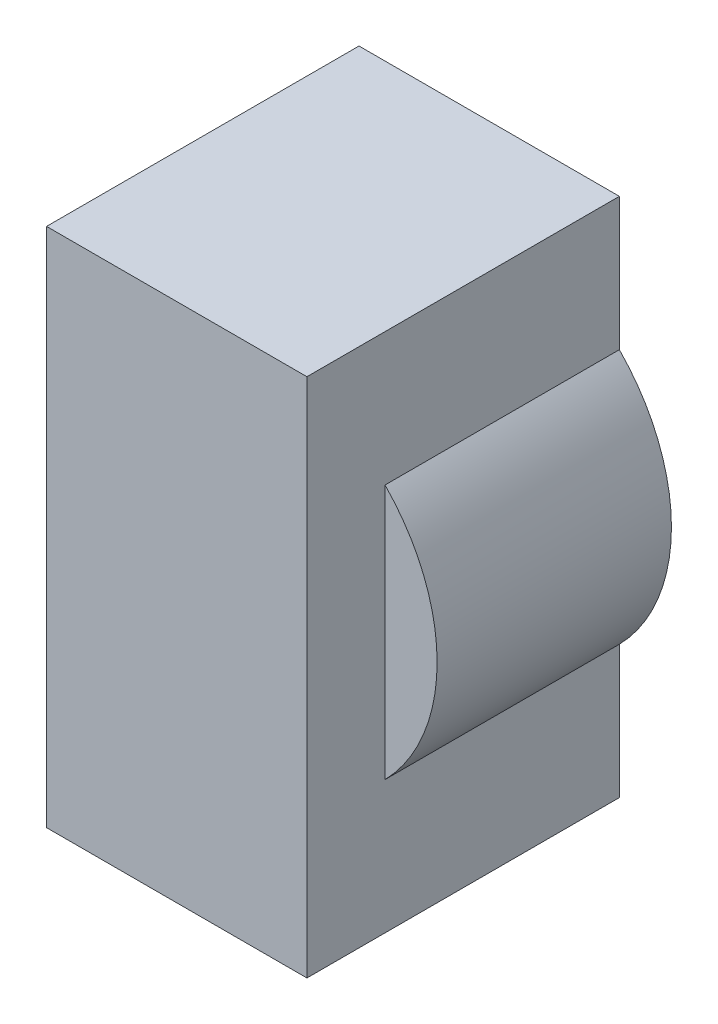
ISO-10303-21;
HEADER;
FILE_DESCRIPTION(('STEP AP214'),'2;1');
FILE_NAME('part.step','',(''),(''),'','','');
FILE_SCHEMA(('AUTOMOTIVE_DESIGN { 1 0 10303 214 1 1 1 1 }'));
ENDSEC;
DATA;
#1=APPLICATION_CONTEXT('core data for automotive mechanical design processes');
#2=APPLICATION_PROTOCOL_DEFINITION('international standard','automotive_design',2000,#1);
#3=PRODUCT_CONTEXT('',#1,'mechanical');
#4=PRODUCT('Part','Part','',(#3));
#5=PRODUCT_RELATED_PRODUCT_CATEGORY('part','',(#4));
#6=PRODUCT_DEFINITION_FORMATION('','',#4);
#7=PRODUCT_DEFINITION_CONTEXT('part definition',#1,'design');
#8=PRODUCT_DEFINITION('design','',#6,#7);
#9=PRODUCT_DEFINITION_SHAPE('','',#8);
#10=(LENGTH_UNIT() NAMED_UNIT(*) SI_UNIT(.MILLI.,.METRE.));
#11=(NAMED_UNIT(*) PLANE_ANGLE_UNIT() SI_UNIT($,.RADIAN.));
#12=(NAMED_UNIT(*) SI_UNIT($,.STERADIAN.) SOLID_ANGLE_UNIT());
#13=UNCERTAINTY_MEASURE_WITH_UNIT(LENGTH_MEASURE(1.E-05),#10,'distance_accuracy_value','');
#14=(GEOMETRIC_REPRESENTATION_CONTEXT(3) GLOBAL_UNCERTAINTY_ASSIGNED_CONTEXT((#13)) GLOBAL_UNIT_ASSIGNED_CONTEXT((#10,
#11,#12)) REPRESENTATION_CONTEXT('',''));
#15=CARTESIAN_POINT('',(0.,0.,0.));
#16=DIRECTION('',(0.,0.,1.));
#17=DIRECTION('',(1.,0.,0.));
#18=AXIS2_PLACEMENT_3D('',#15,#16,#17);
#19=CARTESIAN_POINT('',(-2.11893799901009,-0.126876243956829,6.));
#20=DIRECTION('',(1.,0.,0.));
#21=DIRECTION('',(0.,1.,4.37113882867379E-08));
#22=AXIS2_PLACEMENT_3D('',#19,#20,#21);
#23=PLANE('',#22);
#24=DIRECTION('',(0.,4.37113880893649E-08,-0.999999999999999));
#25=VECTOR('',#24,1.);
#26=CARTESIAN_POINT('',(-2.11893799901009,-2.57636592117275,4.4999998929294));
#27=LINE('',#26,#25);
#28=CARTESIAN_POINT('',(-2.11893799901009,-2.57636592117275,4.4999998929294));
#29=VERTEX_POINT('',#28);
#30=CARTESIAN_POINT('',(-2.11893799901009,-2.5763657244715,-1.0707059725117E-07));
#31=VERTEX_POINT('',#30);
#32=EDGE_CURVE('E11',#29,#31,#27,.T.);
#33=ORIENTED_EDGE('',*,*,#32,.T.);
#34=DIRECTION('',(0.,-0.999999999999999,-4.37113882867379E-08));
#35=VECTOR('',#34,1.);
#36=CARTESIAN_POINT('',(-2.11893799901009,-2.5763657244715,-1.0707059725117E-07));
#37=LINE('',#36,#35);
#38=CARTESIAN_POINT('',(-2.11893799901009,-5.1268759816885,-2.1855694143369E-07));
#39=VERTEX_POINT('',#38);
#40=EDGE_CURVE('E141',#31,#39,#37,.T.);
#41=ORIENTED_EDGE('',*,*,#40,.T.);
#42=DIRECTION('',(0.,4.37113882867379E-08,-0.999999999999999));
#43=VECTOR('',#42,1.);
#44=CARTESIAN_POINT('',(-2.11893799901009,-5.12687624395683,5.99999978144306));
#45=LINE('',#44,#43);
#46=CARTESIAN_POINT('',(-2.11893799901009,-5.12687624395683,5.99999978144306));
#47=VERTEX_POINT('',#46);
#48=EDGE_CURVE('E132',#47,#39,#45,.T.);
#49=ORIENTED_EDGE('',*,*,#48,.F.);
#50=DIRECTION('',(0.,-0.999999999999999,-4.37113882867379E-08));
#51=VECTOR('',#50,1.);
#52=CARTESIAN_POINT('',(-2.11893799901009,4.87312375604317,6.00000021855694));
#53=LINE('',#52,#51);
#54=CARTESIAN_POINT('',(-2.11893799901009,4.87312375604317,6.00000021855694));
#55=VERTEX_POINT('',#54);
#56=EDGE_CURVE('E121',#55,#47,#53,.T.);
#57=ORIENTED_EDGE('',*,*,#56,.F.);
#58=DIRECTION('',(0.,4.37113882867379E-08,-0.999999999999999));
#59=VECTOR('',#58,1.);
#60=CARTESIAN_POINT('',(-2.11893799901009,4.87312375604317,6.00000021855694));
#61=LINE('',#60,#59);
#62=CARTESIAN_POINT('',(-2.11893799901009,4.8731240183115,2.1855694143369E-07));
#63=VERTEX_POINT('',#62);
#64=EDGE_CURVE('E127',#55,#63,#61,.T.);
#65=ORIENTED_EDGE('',*,*,#64,.T.);
#66=DIRECTION('',(0.,-0.999999999999999,-4.37113882867379E-08));
#67=VECTOR('',#66,1.);
#68=CARTESIAN_POINT('',(-2.11893799901009,4.8731240183115,2.1855694143369E-07));
#69=LINE('',#68,#67);
#70=CARTESIAN_POINT('',(-2.11893799901009,2.3226137610945,1.0707059725117E-07));
#71=VERTEX_POINT('',#70);
#72=EDGE_CURVE('E101',#63,#71,#69,.T.);
#73=ORIENTED_EDGE('',*,*,#72,.T.);
#74=DIRECTION('',(0.,4.37113884841109E-08,-0.999999999999999));
#75=VECTOR('',#74,1.);
#76=CARTESIAN_POINT('',(-2.11893799901009,2.32261356439325,4.5000001070706));
#77=LINE('',#76,#75);
#78=CARTESIAN_POINT('',(-2.11893799901009,2.32261356439325,4.5000001070706));
#79=VERTEX_POINT('',#78);
#80=EDGE_CURVE('E79',#79,#71,#77,.T.);
#81=ORIENTED_EDGE('',*,*,#80,.F.);
#82=DIRECTION('',(0.,-0.999999999999999,-4.37113881160721E-08));
#83=VECTOR('',#82,1.);
#84=CARTESIAN_POINT('',(-2.11893799901009,2.32261356439325,4.5000001070706));
#85=LINE('',#84,#83);
#86=EDGE_CURVE('E77',#79,#29,#85,.T.);
#87=ORIENTED_EDGE('',*,*,#86,.T.);
#88=EDGE_LOOP('',(#33,#41,#49,#57,#65,#73,#81,#87));
#89=FACE_BOUND('',#88,.T.);
#90=ADVANCED_FACE('F17',(#89),#23,.F.);
#91=CARTESIAN_POINT('',(2.88106200098991,-0.126876243956829,6.));
#92=DIRECTION('',(1.,0.,0.));
#93=DIRECTION('',(0.,1.,4.37113882867379E-08));
#94=AXIS2_PLACEMENT_3D('',#91,#92,#93);
#95=PLANE('',#94);
#96=DIRECTION('',(0.,-0.999999999999999,-4.37113882867379E-08));
#97=VECTOR('',#96,1.);
#98=CARTESIAN_POINT('',(2.88106200098991,-2.5763657244715,-1.0707059725117E-07));
#99=LINE('',#98,#97);
#100=CARTESIAN_POINT('',(2.88106200098991,-2.5763657244715,-1.0707059725117E-07));
#101=VERTEX_POINT('',#100);
#102=CARTESIAN_POINT('',(2.88106200098991,-5.1268759816885,-2.1855694143369E-07));
#103=VERTEX_POINT('',#102);
#104=EDGE_CURVE('E24',#101,#103,#99,.T.);
#105=ORIENTED_EDGE('',*,*,#104,.F.);
#106=DIRECTION('',(0.,4.37113880893649E-08,-0.999999999999999));
#107=VECTOR('',#106,1.);
#108=CARTESIAN_POINT('',(2.88106200098991,-2.57636592117275,4.4999998929294));
#109=LINE('',#108,#107);
#110=CARTESIAN_POINT('',(2.88106200098991,-2.57636592117275,4.4999998929294));
#111=VERTEX_POINT('',#110);
#112=EDGE_CURVE('E135',#111,#101,#109,.T.);
#113=ORIENTED_EDGE('',*,*,#112,.F.);
#114=DIRECTION('',(0.,-0.999999999999999,-4.37113881160721E-08));
#115=VECTOR('',#114,1.);
#116=CARTESIAN_POINT('',(2.88106200098991,2.32261356439325,4.5000001070706));
#117=LINE('',#116,#115);
#118=CARTESIAN_POINT('',(2.88106200098991,2.32261356439325,4.5000001070706));
#119=VERTEX_POINT('',#118);
#120=EDGE_CURVE('E124',#119,#111,#117,.T.);
#121=ORIENTED_EDGE('',*,*,#120,.F.);
#122=DIRECTION('',(0.,4.37113884841109E-08,-0.999999999999999));
#123=VECTOR('',#122,1.);
#124=CARTESIAN_POINT('',(2.88106200098991,2.32261356439325,4.5000001070706));
#125=LINE('',#124,#123);
#126=CARTESIAN_POINT('',(2.88106200098991,2.3226137610945,1.0707059725117E-07));
#127=VERTEX_POINT('',#126);
#128=EDGE_CURVE('E111',#119,#127,#125,.T.);
#129=ORIENTED_EDGE('',*,*,#128,.T.);
#130=DIRECTION('',(0.,-0.999999999999999,-4.37113882867379E-08));
#131=VECTOR('',#130,1.);
#132=CARTESIAN_POINT('',(2.88106200098991,4.8731240183115,2.1855694143369E-07));
#133=LINE('',#132,#131);
#134=CARTESIAN_POINT('',(2.88106200098991,4.8731240183115,2.1855694143369E-07));
#135=VERTEX_POINT('',#134);
#136=EDGE_CURVE('E108',#135,#127,#133,.T.);
#137=ORIENTED_EDGE('',*,*,#136,.F.);
#138=DIRECTION('',(0.,4.37113882867379E-08,-0.999999999999999));
#139=VECTOR('',#138,1.);
#140=CARTESIAN_POINT('',(2.88106200098991,4.87312375604317,6.00000021855694));
#141=LINE('',#140,#139);
#142=CARTESIAN_POINT('',(2.88106200098991,4.87312375604317,6.00000021855694));
#143=VERTEX_POINT('',#142);
#144=EDGE_CURVE('E103',#143,#135,#141,.T.);
#145=ORIENTED_EDGE('',*,*,#144,.F.);
#146=DIRECTION('',(0.,-0.999999999999999,-4.37113882867379E-08));
#147=VECTOR('',#146,1.);
#148=CARTESIAN_POINT('',(2.88106200098991,4.87312375604317,6.00000021855694));
#149=LINE('',#148,#147);
#150=CARTESIAN_POINT('',(2.88106200098991,-5.12687624395683,5.99999978144306));
#151=VERTEX_POINT('',#150);
#152=EDGE_CURVE('E118',#143,#151,#149,.T.);
#153=ORIENTED_EDGE('',*,*,#152,.T.);
#154=DIRECTION('',(0.,4.37113882867379E-08,-0.999999999999999));
#155=VECTOR('',#154,1.);
#156=CARTESIAN_POINT('',(2.88106200098991,-5.12687624395683,5.99999978144306));
#157=LINE('',#156,#155);
#158=EDGE_CURVE('E116',#151,#103,#157,.T.);
#159=ORIENTED_EDGE('',*,*,#158,.T.);
#160=EDGE_LOOP('',(#105,#113,#121,#129,#137,#145,#153,#159));
#161=FACE_BOUND('',#160,.T.);
#162=ADVANCED_FACE('F145',(#161),#95,.T.);
#163=CARTESIAN_POINT('',(0.381062000989914,4.87312375604317,6.00000021855694));
#164=DIRECTION('',(0.,1.,4.37113882867379E-08));
#165=DIRECTION('',(-1.,0.,0.));
#166=AXIS2_PLACEMENT_3D('',#163,#164,#165);
#167=PLANE('',#166);
#168=DIRECTION('',(1.,0.,0.));
#169=VECTOR('',#168,1.);
#170=CARTESIAN_POINT('',(-2.11893799901009,4.8731240183115,2.1855694143369E-07));
#171=LINE('',#170,#169);
#172=EDGE_CURVE('E138',#63,#135,#171,.T.);
#173=ORIENTED_EDGE('',*,*,#172,.F.);
#174=ORIENTED_EDGE('',*,*,#64,.F.);
#175=DIRECTION('',(1.,0.,0.));
#176=VECTOR('',#175,1.);
#177=CARTESIAN_POINT('',(-2.11893799901009,4.87312375604317,6.00000021855694));
#178=LINE('',#177,#176);
#179=EDGE_CURVE('E113',#55,#143,#178,.T.);
#180=ORIENTED_EDGE('',*,*,#179,.T.);
#181=ORIENTED_EDGE('',*,*,#144,.T.);
#182=EDGE_LOOP('',(#173,#174,#180,#181));
#183=FACE_BOUND('',#182,.T.);
#184=ADVANCED_FACE('F157',(#183),#167,.T.);
#185=CARTESIAN_POINT('',(0.381062000989914,-5.12687624395683,5.99999978144306));
#186=DIRECTION('',(0.,1.,4.37113882867379E-08));
#187=DIRECTION('',(-1.,0.,0.));
#188=AXIS2_PLACEMENT_3D('',#185,#186,#187);
#189=PLANE('',#188);
#190=DIRECTION('',(1.,0.,0.));
#191=VECTOR('',#190,1.);
#192=CARTESIAN_POINT('',(-2.11893799901009,-5.1268759816885,-2.1855694143369E-07));
#193=LINE('',#192,#191);
#194=EDGE_CURVE('E130',#39,#103,#193,.T.);
#195=ORIENTED_EDGE('',*,*,#194,.T.);
#196=ORIENTED_EDGE('',*,*,#158,.F.);
#197=DIRECTION('',(1.,0.,0.));
#198=VECTOR('',#197,1.);
#199=CARTESIAN_POINT('',(-2.11893799901009,-5.12687624395683,5.99999978144306));
#200=LINE('',#199,#198);
#201=EDGE_CURVE('E105',#47,#151,#200,.T.);
#202=ORIENTED_EDGE('',*,*,#201,.F.);
#203=ORIENTED_EDGE('',*,*,#48,.T.);
#204=EDGE_LOOP('',(#195,#196,#202,#203));
#205=FACE_BOUND('',#204,.T.);
#206=ADVANCED_FACE('F149',(#205),#189,.F.);
#207=CARTESIAN_POINT('',(0.381062000989914,-0.126876243956829,6.));
#208=DIRECTION('',(0.,-4.37113882867379E-08,1.));
#209=DIRECTION('',(0.,-1.,-4.37113882867379E-08));
#210=AXIS2_PLACEMENT_3D('',#207,#208,#209);
#211=PLANE('',#210);
#212=ORIENTED_EDGE('',*,*,#152,.F.);
#213=ORIENTED_EDGE('',*,*,#179,.F.);
#214=ORIENTED_EDGE('',*,*,#56,.T.);
#215=ORIENTED_EDGE('',*,*,#201,.T.);
#216=EDGE_LOOP('',(#212,#213,#214,#215));
#217=FACE_BOUND('',#216,.T.);
#218=ADVANCED_FACE('F151',(#217),#211,.T.);
#219=CARTESIAN_POINT('',(0.381062000989914,-0.126875981688499,0.));
#220=DIRECTION('',(0.,-4.37113882867379E-08,1.));
#221=DIRECTION('',(0.,-1.,-4.37113882867379E-08));
#222=AXIS2_PLACEMENT_3D('',#219,#220,#221);
#223=PLANE('',#222);
#224=ORIENTED_EDGE('',*,*,#136,.T.);
#225=CARTESIAN_POINT('',(0.38106200098991,-0.126875981688499,0.));
#226=DIRECTION('',(0.,-4.37113882867379E-08,1.));
#227=DIRECTION('',(0.71428571428574,-0.699854212223739,-3.05915992146209E-08));
#228=AXIS2_PLACEMENT_3D('',#225,#226,#227);
#229=CIRCLE('',#228,3.5);
#230=EDGE_CURVE('E98',#101,#127,#229,.T.);
#231=ORIENTED_EDGE('',*,*,#230,.F.);
#232=ORIENTED_EDGE('',*,*,#104,.T.);
#233=ORIENTED_EDGE('',*,*,#194,.F.);
#234=ORIENTED_EDGE('',*,*,#40,.F.);
#235=CARTESIAN_POINT('',(0.38106200098991,-0.126875981688499,0.));
#236=DIRECTION('',(0.,-4.37113882867379E-08,1.));
#237=DIRECTION('',(-0.714285714285739,0.69985421222374,3.0591599214621E-08));
#238=AXIS2_PLACEMENT_3D('',#235,#236,#237);
#239=CIRCLE('',#238,3.5);
#240=EDGE_CURVE('E83',#71,#31,#239,.T.);
#241=ORIENTED_EDGE('',*,*,#240,.F.);
#242=ORIENTED_EDGE('',*,*,#72,.F.);
#243=ORIENTED_EDGE('',*,*,#172,.T.);
#244=EDGE_LOOP('',(#224,#231,#232,#233,#234,#241,#242,#243));
#245=FACE_BOUND('',#244,.T.);
#246=ADVANCED_FACE('F144',(#245),#223,.F.);
#247=CARTESIAN_POINT('',(0.38106200098991,-0.126876178389747,4.5));
#248=DIRECTION('',(0.,4.37113882867379E-08,-1.));
#249=DIRECTION('',(0.,1.,4.37113882867379E-08));
#250=AXIS2_PLACEMENT_3D('',#247,#248,#249);
#251=CYLINDRICAL_SURFACE('',#250,3.5);
#252=ORIENTED_EDGE('',*,*,#230,.T.);
#253=ORIENTED_EDGE('',*,*,#128,.F.);
#254=CARTESIAN_POINT('',(0.38106200098991,-0.126876178389747,4.5));
#255=DIRECTION('',(0.,-4.37113882867379E-08,1.));
#256=DIRECTION('',(0.71428571428574,-0.699854212223739,-3.05915992146209E-08));
#257=AXIS2_PLACEMENT_3D('',#254,#255,#256);
#258=CIRCLE('',#257,3.5);
#259=EDGE_CURVE('E91',#111,#119,#258,.T.);
#260=ORIENTED_EDGE('',*,*,#259,.F.);
#261=ORIENTED_EDGE('',*,*,#112,.T.);
#262=EDGE_LOOP('',(#252,#253,#260,#261));
#263=FACE_BOUND('',#262,.T.);
#264=ADVANCED_FACE('F161',(#263),#251,.T.);
#265=CARTESIAN_POINT('',(0.381062000989914,-0.126876178389747,4.5));
#266=DIRECTION('',(0.,-4.37113882867379E-08,1.));
#267=DIRECTION('',(0.,-1.,-4.37113882867379E-08));
#268=AXIS2_PLACEMENT_3D('',#265,#266,#267);
#269=PLANE('',#268);
#270=ORIENTED_EDGE('',*,*,#120,.T.);
#271=ORIENTED_EDGE('',*,*,#259,.T.);
#272=EDGE_LOOP('',(#270,#271));
#273=FACE_BOUND('',#272,.T.);
#274=ADVANCED_FACE('F163',(#273),#269,.T.);
#275=CARTESIAN_POINT('',(0.38106200098991,-0.126876178389747,4.5));
#276=DIRECTION('',(0.,4.37113882867379E-08,-1.));
#277=DIRECTION('',(0.,1.,4.37113882867379E-08));
#278=AXIS2_PLACEMENT_3D('',#275,#276,#277);
#279=CYLINDRICAL_SURFACE('',#278,3.5);
#280=ORIENTED_EDGE('',*,*,#240,.T.);
#281=ORIENTED_EDGE('',*,*,#32,.F.);
#282=CARTESIAN_POINT('',(0.38106200098991,-0.126876178389747,4.5));
#283=DIRECTION('',(0.,-4.37113882867379E-08,1.));
#284=DIRECTION('',(-0.714285714285739,0.69985421222374,3.0591599214621E-08));
#285=AXIS2_PLACEMENT_3D('',#282,#283,#284);
#286=CIRCLE('',#285,3.5);
#287=EDGE_CURVE('E87',#79,#29,#286,.T.);
#288=ORIENTED_EDGE('',*,*,#287,.F.);
#289=ORIENTED_EDGE('',*,*,#80,.T.);
#290=EDGE_LOOP('',(#280,#281,#288,#289));
#291=FACE_BOUND('',#290,.T.);
#292=ADVANCED_FACE('F86',(#291),#279,.T.);
#293=CARTESIAN_POINT('',(0.381062000989914,-0.126876178389747,4.5));
#294=DIRECTION('',(0.,-4.37113882867379E-08,1.));
#295=DIRECTION('',(0.,-1.,-4.37113882867379E-08));
#296=AXIS2_PLACEMENT_3D('',#293,#294,#295);
#297=PLANE('',#296);
#298=ORIENTED_EDGE('',*,*,#86,.F.);
#299=ORIENTED_EDGE('',*,*,#287,.T.);
#300=EDGE_LOOP('',(#298,#299));
#301=FACE_BOUND('',#300,.T.);
#302=ADVANCED_FACE('F90',(#301),#297,.T.);
#303=CLOSED_SHELL('',(#90,#162,#184,#206,#218,#246,#264,#274,#292,#302));
#304=MANIFOLD_SOLID_BREP('B1',#303);
#305=ADVANCED_BREP_SHAPE_REPRESENTATION('',(#18,#304),#14);
#306=SHAPE_DEFINITION_REPRESENTATION(#9,#305);
ENDSEC;
END-ISO-10303-21;
